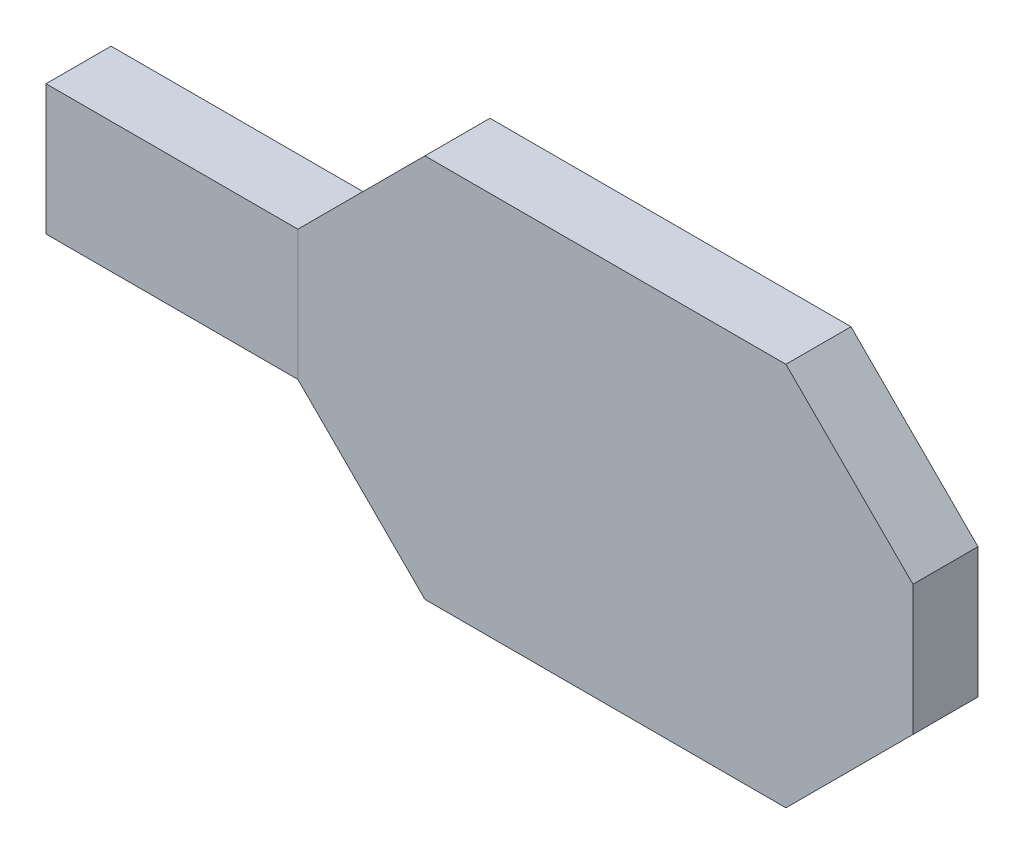
ISO-10303-21;
HEADER;
FILE_DESCRIPTION(('STEP AP214'),'2;1');
FILE_NAME('part.step','',(''),(''),'','','');
FILE_SCHEMA(('AUTOMOTIVE_DESIGN { 1 0 10303 214 1 1 1 1 }'));
ENDSEC;
DATA;
#1=APPLICATION_CONTEXT('core data for automotive mechanical design processes');
#2=APPLICATION_PROTOCOL_DEFINITION('international standard','automotive_design',2000,#1);
#3=PRODUCT_CONTEXT('',#1,'mechanical');
#4=PRODUCT('Part','Part','',(#3));
#5=PRODUCT_RELATED_PRODUCT_CATEGORY('part','',(#4));
#6=PRODUCT_DEFINITION_FORMATION('','',#4);
#7=PRODUCT_DEFINITION_CONTEXT('part definition',#1,'design');
#8=PRODUCT_DEFINITION('design','',#6,#7);
#9=PRODUCT_DEFINITION_SHAPE('','',#8);
#10=(LENGTH_UNIT() NAMED_UNIT(*) SI_UNIT(.MILLI.,.METRE.));
#11=(NAMED_UNIT(*) PLANE_ANGLE_UNIT() SI_UNIT($,.RADIAN.));
#12=(NAMED_UNIT(*) SI_UNIT($,.STERADIAN.) SOLID_ANGLE_UNIT());
#13=UNCERTAINTY_MEASURE_WITH_UNIT(LENGTH_MEASURE(1.E-05),#10,'distance_accuracy_value','');
#14=(GEOMETRIC_REPRESENTATION_CONTEXT(3) GLOBAL_UNCERTAINTY_ASSIGNED_CONTEXT((#13)) GLOBAL_UNIT_ASSIGNED_CONTEXT((#10,
#11,#12)) REPRESENTATION_CONTEXT('',''));
#15=CARTESIAN_POINT('',(0.,0.,0.));
#16=DIRECTION('',(0.,0.,1.));
#17=DIRECTION('',(1.,0.,0.));
#18=AXIS2_PLACEMENT_3D('',#15,#16,#17);
#19=CARTESIAN_POINT('',(0.3,1.385,0.));
#20=DIRECTION('',(0.,-1.,0.));
#21=DIRECTION('',(0.,0.,-1.));
#22=AXIS2_PLACEMENT_3D('',#19,#20,#21);
#23=PLANE('',#22);
#24=DIRECTION('',(0.,0.,1.));
#25=VECTOR('',#24,1.);
#26=CARTESIAN_POINT('',(0.905,1.385,0.));
#27=LINE('',#26,#25);
#28=CARTESIAN_POINT('',(0.905,1.385,0.));
#29=VERTEX_POINT('',#28);
#30=CARTESIAN_POINT('',(0.905,1.385,0.31));
#31=VERTEX_POINT('',#30);
#32=EDGE_CURVE('E127',#29,#31,#27,.T.);
#33=ORIENTED_EDGE('',*,*,#32,.F.);
#34=DIRECTION('',(1.,0.,0.));
#35=VECTOR('',#34,1.);
#36=CARTESIAN_POINT('',(0.3,1.385,0.));
#37=LINE('',#36,#35);
#38=CARTESIAN_POINT('',(2.625,1.385,0.));
#39=VERTEX_POINT('',#38);
#40=EDGE_CURVE('E130',#29,#39,#37,.T.);
#41=ORIENTED_EDGE('',*,*,#40,.T.);
#42=DIRECTION('',(0.,0.,1.));
#43=VECTOR('',#42,1.);
#44=CARTESIAN_POINT('',(2.625,1.385,0.));
#45=LINE('',#44,#43);
#46=CARTESIAN_POINT('',(2.625,1.385,0.31));
#47=VERTEX_POINT('',#46);
#48=EDGE_CURVE('E11',#39,#47,#45,.T.);
#49=ORIENTED_EDGE('',*,*,#48,.T.);
#50=DIRECTION('',(1.,0.,0.));
#51=VECTOR('',#50,1.);
#52=CARTESIAN_POINT('',(0.3,1.385,0.31));
#53=LINE('',#52,#51);
#54=EDGE_CURVE('E133',#31,#47,#53,.T.);
#55=ORIENTED_EDGE('',*,*,#54,.F.);
#56=EDGE_LOOP('',(#33,#41,#49,#55));
#57=FACE_BOUND('',#56,.T.);
#58=ADVANCED_FACE('F16',(#57),#23,.T.);
#59=CARTESIAN_POINT('',(2.625,1.385,0.));
#60=DIRECTION('',(-0.707106781186548,0.707106781186548,0.));
#61=DIRECTION('',(0.,0.,1.));
#62=AXIS2_PLACEMENT_3D('',#59,#60,#61);
#63=PLANE('',#62);
#64=ORIENTED_EDGE('',*,*,#48,.F.);
#65=DIRECTION('',(0.707106781186548,0.707106781186548,0.));
#66=VECTOR('',#65,1.);
#67=CARTESIAN_POINT('',(2.625,1.385,0.));
#68=LINE('',#67,#66);
#69=CARTESIAN_POINT('',(3.23,1.99,0.));
#70=VERTEX_POINT('',#69);
#71=EDGE_CURVE('E153',#39,#70,#68,.T.);
#72=ORIENTED_EDGE('',*,*,#71,.T.);
#73=DIRECTION('',(0.,0.,1.));
#74=VECTOR('',#73,1.);
#75=CARTESIAN_POINT('',(3.23,1.99,0.));
#76=LINE('',#75,#74);
#77=CARTESIAN_POINT('',(3.23,1.99,0.31));
#78=VERTEX_POINT('',#77);
#79=EDGE_CURVE('E27',#70,#78,#76,.T.);
#80=ORIENTED_EDGE('',*,*,#79,.T.);
#81=DIRECTION('',(0.707106781186548,0.707106781186548,0.));
#82=VECTOR('',#81,1.);
#83=CARTESIAN_POINT('',(2.625,1.385,0.31));
#84=LINE('',#83,#82);
#85=EDGE_CURVE('E182',#47,#78,#84,.T.);
#86=ORIENTED_EDGE('',*,*,#85,.F.);
#87=EDGE_LOOP('',(#64,#72,#80,#86));
#88=FACE_BOUND('',#87,.T.);
#89=ADVANCED_FACE('F419',(#88),#63,.F.);
#90=CARTESIAN_POINT('',(3.23,3.215,0.));
#91=DIRECTION('',(1.,0.,0.));
#92=DIRECTION('',(0.,1.,0.));
#93=AXIS2_PLACEMENT_3D('',#90,#91,#92);
#94=PLANE('',#93);
#95=DIRECTION('',(0.,-1.,0.));
#96=VECTOR('',#95,1.);
#97=CARTESIAN_POINT('',(3.23,3.215,0.));
#98=LINE('',#97,#96);
#99=CARTESIAN_POINT('',(3.23,2.61,0.));
#100=VERTEX_POINT('',#99);
#101=EDGE_CURVE('E160',#100,#70,#98,.T.);
#102=ORIENTED_EDGE('',*,*,#101,.F.);
#103=DIRECTION('',(0.,0.,1.));
#104=VECTOR('',#103,1.);
#105=CARTESIAN_POINT('',(3.23,2.61,0.));
#106=LINE('',#105,#104);
#107=CARTESIAN_POINT('',(3.23,2.61,0.31));
#108=VERTEX_POINT('',#107);
#109=EDGE_CURVE('E41',#100,#108,#106,.T.);
#110=ORIENTED_EDGE('',*,*,#109,.T.);
#111=DIRECTION('',(0.,-1.,0.));
#112=VECTOR('',#111,1.);
#113=CARTESIAN_POINT('',(3.23,3.215,0.31));
#114=LINE('',#113,#112);
#115=EDGE_CURVE('E179',#108,#78,#114,.T.);
#116=ORIENTED_EDGE('',*,*,#115,.T.);
#117=ORIENTED_EDGE('',*,*,#79,.F.);
#118=EDGE_LOOP('',(#102,#110,#116,#117));
#119=FACE_BOUND('',#118,.T.);
#120=ADVANCED_FACE('F377',(#119),#94,.T.);
#121=CARTESIAN_POINT('',(3.23,2.61,0.));
#122=DIRECTION('',(-0.707106781186548,-0.707106781186548,0.));
#123=DIRECTION('',(-0.707106781186548,0.707106781186548,0.));
#124=AXIS2_PLACEMENT_3D('',#121,#122,#123);
#125=PLANE('',#124);
#126=ORIENTED_EDGE('',*,*,#109,.F.);
#127=DIRECTION('',(-0.707106781186548,0.707106781186548,0.));
#128=VECTOR('',#127,1.);
#129=CARTESIAN_POINT('',(3.23,2.61,0.));
#130=LINE('',#129,#128);
#131=CARTESIAN_POINT('',(2.625,3.215,0.));
#132=VERTEX_POINT('',#131);
#133=EDGE_CURVE('E171',#100,#132,#130,.T.);
#134=ORIENTED_EDGE('',*,*,#133,.T.);
#135=DIRECTION('',(0.,0.,1.));
#136=VECTOR('',#135,1.);
#137=CARTESIAN_POINT('',(2.625,3.215,0.));
#138=LINE('',#137,#136);
#139=CARTESIAN_POINT('',(2.625,3.215,0.31));
#140=VERTEX_POINT('',#139);
#141=EDGE_CURVE('E20',#132,#140,#138,.T.);
#142=ORIENTED_EDGE('',*,*,#141,.T.);
#143=DIRECTION('',(-0.707106781186548,0.707106781186548,0.));
#144=VECTOR('',#143,1.);
#145=CARTESIAN_POINT('',(3.23,2.61,0.31));
#146=LINE('',#145,#144);
#147=EDGE_CURVE('E181',#108,#140,#146,.T.);
#148=ORIENTED_EDGE('',*,*,#147,.F.);
#149=EDGE_LOOP('',(#126,#134,#142,#148));
#150=FACE_BOUND('',#149,.T.);
#151=ADVANCED_FACE('F265',(#150),#125,.F.);
#152=CARTESIAN_POINT('',(0.3,3.215,0.));
#153=DIRECTION('',(0.,-1.,0.));
#154=DIRECTION('',(0.,0.,-1.));
#155=AXIS2_PLACEMENT_3D('',#152,#153,#154);
#156=PLANE('',#155);
#157=DIRECTION('',(0.,0.,1.));
#158=VECTOR('',#157,1.);
#159=CARTESIAN_POINT('',(0.905,3.215,0.));
#160=LINE('',#159,#158);
#161=CARTESIAN_POINT('',(0.905,3.215,0.));
#162=VERTEX_POINT('',#161);
#163=CARTESIAN_POINT('',(0.905,3.215,0.31));
#164=VERTEX_POINT('',#163);
#165=EDGE_CURVE('E115',#162,#164,#160,.T.);
#166=ORIENTED_EDGE('',*,*,#165,.T.);
#167=DIRECTION('',(1.,0.,0.));
#168=VECTOR('',#167,1.);
#169=CARTESIAN_POINT('',(0.3,3.215,0.31));
#170=LINE('',#169,#168);
#171=EDGE_CURVE('E167',#164,#140,#170,.T.);
#172=ORIENTED_EDGE('',*,*,#171,.T.);
#173=ORIENTED_EDGE('',*,*,#141,.F.);
#174=DIRECTION('',(1.,0.,0.));
#175=VECTOR('',#174,1.);
#176=CARTESIAN_POINT('',(0.3,3.215,0.));
#177=LINE('',#176,#175);
#178=EDGE_CURVE('E168',#162,#132,#177,.T.);
#179=ORIENTED_EDGE('',*,*,#178,.F.);
#180=EDGE_LOOP('',(#166,#172,#173,#179));
#181=FACE_BOUND('',#180,.T.);
#182=ADVANCED_FACE('F262',(#181),#156,.F.);
#183=CARTESIAN_POINT('',(0.905,3.215,0.));
#184=DIRECTION('',(0.707106781186548,-0.707106781186548,0.));
#185=DIRECTION('',(0.,0.,-1.));
#186=AXIS2_PLACEMENT_3D('',#183,#184,#185);
#187=PLANE('',#186);
#188=ORIENTED_EDGE('',*,*,#165,.F.);
#189=DIRECTION('',(-0.707106781186548,-0.707106781186548,0.));
#190=VECTOR('',#189,1.);
#191=CARTESIAN_POINT('',(0.905,3.215,0.));
#192=LINE('',#191,#190);
#193=CARTESIAN_POINT('',(0.3,2.61,0.));
#194=VERTEX_POINT('',#193);
#195=EDGE_CURVE('E139',#162,#194,#192,.T.);
#196=ORIENTED_EDGE('',*,*,#195,.T.);
#197=DIRECTION('',(0.,0.,1.));
#198=VECTOR('',#197,1.);
#199=CARTESIAN_POINT('',(0.3,2.61,0.));
#200=LINE('',#199,#198);
#201=CARTESIAN_POINT('',(0.3,2.61,0.31));
#202=VERTEX_POINT('',#201);
#203=EDGE_CURVE('E172',#194,#202,#200,.T.);
#204=ORIENTED_EDGE('',*,*,#203,.T.);
#205=DIRECTION('',(-0.707106781186548,-0.707106781186548,0.));
#206=VECTOR('',#205,1.);
#207=CARTESIAN_POINT('',(0.905,3.215,0.31));
#208=LINE('',#207,#206);
#209=EDGE_CURVE('E195',#164,#202,#208,.T.);
#210=ORIENTED_EDGE('',*,*,#209,.F.);
#211=EDGE_LOOP('',(#188,#196,#204,#210));
#212=FACE_BOUND('',#211,.T.);
#213=ADVANCED_FACE('F405',(#212),#187,.F.);
#214=CARTESIAN_POINT('',(0.3,3.215,0.31));
#215=DIRECTION('',(0.,0.,1.));
#216=DIRECTION('',(1.,0.,0.));
#217=AXIS2_PLACEMENT_3D('',#214,#215,#216);
#218=PLANE('',#217);
#219=ORIENTED_EDGE('',*,*,#171,.F.);
#220=ORIENTED_EDGE('',*,*,#209,.T.);
#221=DIRECTION('',(0.,-1.,0.));
#222=VECTOR('',#221,1.);
#223=CARTESIAN_POINT('',(0.3,3.215,0.31));
#224=LINE('',#223,#222);
#225=CARTESIAN_POINT('',(0.3,1.99,0.31));
#226=VERTEX_POINT('',#225);
#227=EDGE_CURVE('E202',#202,#226,#224,.T.);
#228=ORIENTED_EDGE('',*,*,#227,.T.);
#229=DIRECTION('',(0.707106781186548,-0.707106781186548,0.));
#230=VECTOR('',#229,1.);
#231=CARTESIAN_POINT('',(0.3,1.99,0.31));
#232=LINE('',#231,#230);
#233=EDGE_CURVE('E138',#226,#31,#232,.T.);
#234=ORIENTED_EDGE('',*,*,#233,.T.);
#235=ORIENTED_EDGE('',*,*,#54,.T.);
#236=ORIENTED_EDGE('',*,*,#85,.T.);
#237=ORIENTED_EDGE('',*,*,#115,.F.);
#238=ORIENTED_EDGE('',*,*,#147,.T.);
#239=EDGE_LOOP('',(#219,#220,#228,#234,#235,#236,#237,#238));
#240=FACE_BOUND('',#239,.T.);
#241=ADVANCED_FACE('F410',(#240),#218,.T.);
#242=CARTESIAN_POINT('',(0.3,1.99,0.));
#243=DIRECTION('',(0.707106781186548,0.707106781186548,0.));
#244=DIRECTION('',(0.,0.,-1.));
#245=AXIS2_PLACEMENT_3D('',#242,#243,#244);
#246=PLANE('',#245);
#247=DIRECTION('',(0.,0.,1.));
#248=VECTOR('',#247,1.);
#249=CARTESIAN_POINT('',(0.3,1.99,0.));
#250=LINE('',#249,#248);
#251=CARTESIAN_POINT('',(0.3,1.99,0.));
#252=VERTEX_POINT('',#251);
#253=EDGE_CURVE('E143',#252,#226,#250,.T.);
#254=ORIENTED_EDGE('',*,*,#253,.F.);
#255=DIRECTION('',(0.707106781186548,-0.707106781186548,0.));
#256=VECTOR('',#255,1.);
#257=CARTESIAN_POINT('',(0.3,1.99,0.));
#258=LINE('',#257,#256);
#259=EDGE_CURVE('E141',#252,#29,#258,.T.);
#260=ORIENTED_EDGE('',*,*,#259,.T.);
#261=ORIENTED_EDGE('',*,*,#32,.T.);
#262=ORIENTED_EDGE('',*,*,#233,.F.);
#263=EDGE_LOOP('',(#254,#260,#261,#262));
#264=FACE_BOUND('',#263,.T.);
#265=ADVANCED_FACE('F18',(#264),#246,.F.);
#266=CARTESIAN_POINT('',(0.3,3.215,0.));
#267=DIRECTION('',(0.,0.,1.));
#268=DIRECTION('',(1.,0.,0.));
#269=AXIS2_PLACEMENT_3D('',#266,#267,#268);
#270=PLANE('',#269);
#271=ORIENTED_EDGE('',*,*,#178,.T.);
#272=ORIENTED_EDGE('',*,*,#133,.F.);
#273=ORIENTED_EDGE('',*,*,#101,.T.);
#274=ORIENTED_EDGE('',*,*,#71,.F.);
#275=ORIENTED_EDGE('',*,*,#40,.F.);
#276=ORIENTED_EDGE('',*,*,#259,.F.);
#277=DIRECTION('',(0.,-1.,0.));
#278=VECTOR('',#277,1.);
#279=CARTESIAN_POINT('',(0.3,3.215,0.));
#280=LINE('',#279,#278);
#281=EDGE_CURVE('E190',#194,#252,#280,.T.);
#282=ORIENTED_EDGE('',*,*,#281,.F.);
#283=ORIENTED_EDGE('',*,*,#195,.F.);
#284=EDGE_LOOP('',(#271,#272,#273,#274,#275,#276,#282,#283));
#285=FACE_BOUND('',#284,.T.);
#286=ADVANCED_FACE('F150',(#285),#270,.F.);
#287=CARTESIAN_POINT('',(-0.9,2.61,0.));
#288=DIRECTION('',(0.,-1.,0.));
#289=DIRECTION('',(0.,0.,-1.));
#290=AXIS2_PLACEMENT_3D('',#287,#288,#289);
#291=PLANE('',#290);
#292=DIRECTION('',(0.,0.,1.));
#293=VECTOR('',#292,1.);
#294=CARTESIAN_POINT('',(-0.9,2.61,0.));
#295=LINE('',#294,#293);
#296=CARTESIAN_POINT('',(-0.9,2.61,0.));
#297=VERTEX_POINT('',#296);
#298=CARTESIAN_POINT('',(-0.9,2.61,0.31));
#299=VERTEX_POINT('',#298);
#300=EDGE_CURVE('E177',#297,#299,#295,.T.);
#301=ORIENTED_EDGE('',*,*,#300,.T.);
#302=DIRECTION('',(1.,0.,0.));
#303=VECTOR('',#302,1.);
#304=CARTESIAN_POINT('',(-0.9,2.61,0.31));
#305=LINE('',#304,#303);
#306=EDGE_CURVE('E198',#299,#202,#305,.T.);
#307=ORIENTED_EDGE('',*,*,#306,.T.);
#308=ORIENTED_EDGE('',*,*,#203,.F.);
#309=DIRECTION('',(1.,0.,0.));
#310=VECTOR('',#309,1.);
#311=CARTESIAN_POINT('',(-0.9,2.61,0.));
#312=LINE('',#311,#310);
#313=EDGE_CURVE('E186',#297,#194,#312,.T.);
#314=ORIENTED_EDGE('',*,*,#313,.F.);
#315=EDGE_LOOP('',(#301,#307,#308,#314));
#316=FACE_BOUND('',#315,.T.);
#317=ADVANCED_FACE('F258',(#316),#291,.F.);
#318=CARTESIAN_POINT('',(-0.9,2.61,0.31));
#319=DIRECTION('',(0.,0.,1.));
#320=DIRECTION('',(1.,0.,0.));
#321=AXIS2_PLACEMENT_3D('',#318,#319,#320);
#322=PLANE('',#321);
#323=ORIENTED_EDGE('',*,*,#306,.F.);
#324=DIRECTION('',(0.,-1.,0.));
#325=VECTOR('',#324,1.);
#326=CARTESIAN_POINT('',(-0.9,2.61,0.31));
#327=LINE('',#326,#325);
#328=CARTESIAN_POINT('',(-0.9,1.99,0.31));
#329=VERTEX_POINT('',#328);
#330=EDGE_CURVE('E173',#299,#329,#327,.T.);
#331=ORIENTED_EDGE('',*,*,#330,.T.);
#332=DIRECTION('',(1.,0.,0.));
#333=VECTOR('',#332,1.);
#334=CARTESIAN_POINT('',(-0.9,1.99,0.31));
#335=LINE('',#334,#333);
#336=EDGE_CURVE('E203',#329,#226,#335,.T.);
#337=ORIENTED_EDGE('',*,*,#336,.T.);
#338=ORIENTED_EDGE('',*,*,#227,.F.);
#339=EDGE_LOOP('',(#323,#331,#337,#338));
#340=FACE_BOUND('',#339,.T.);
#341=ADVANCED_FACE('F255',(#340),#322,.T.);
#342=CARTESIAN_POINT('',(-0.9,1.99,0.));
#343=DIRECTION('',(0.,-1.,0.));
#344=DIRECTION('',(0.,0.,-1.));
#345=AXIS2_PLACEMENT_3D('',#342,#343,#344);
#346=PLANE('',#345);
#347=DIRECTION('',(0.,0.,1.));
#348=VECTOR('',#347,1.);
#349=CARTESIAN_POINT('',(-0.9,1.99,0.));
#350=LINE('',#349,#348);
#351=CARTESIAN_POINT('',(-0.9,1.99,0.));
#352=VERTEX_POINT('',#351);
#353=EDGE_CURVE('E178',#352,#329,#350,.T.);
#354=ORIENTED_EDGE('',*,*,#353,.F.);
#355=DIRECTION('',(1.,0.,0.));
#356=VECTOR('',#355,1.);
#357=CARTESIAN_POINT('',(-0.9,1.99,0.));
#358=LINE('',#357,#356);
#359=EDGE_CURVE('E213',#352,#252,#358,.T.);
#360=ORIENTED_EDGE('',*,*,#359,.T.);
#361=ORIENTED_EDGE('',*,*,#253,.T.);
#362=ORIENTED_EDGE('',*,*,#336,.F.);
#363=EDGE_LOOP('',(#354,#360,#361,#362));
#364=FACE_BOUND('',#363,.T.);
#365=ADVANCED_FACE('F252',(#364),#346,.T.);
#366=CARTESIAN_POINT('',(-0.9,2.61,0.));
#367=DIRECTION('',(0.,0.,1.));
#368=DIRECTION('',(1.,0.,0.));
#369=AXIS2_PLACEMENT_3D('',#366,#367,#368);
#370=PLANE('',#369);
#371=ORIENTED_EDGE('',*,*,#313,.T.);
#372=ORIENTED_EDGE('',*,*,#281,.T.);
#373=ORIENTED_EDGE('',*,*,#359,.F.);
#374=DIRECTION('',(0.,-1.,0.));
#375=VECTOR('',#374,1.);
#376=CARTESIAN_POINT('',(-0.9,2.61,0.));
#377=LINE('',#376,#375);
#378=EDGE_CURVE('E212',#297,#352,#377,.T.);
#379=ORIENTED_EDGE('',*,*,#378,.F.);
#380=EDGE_LOOP('',(#371,#372,#373,#379));
#381=FACE_BOUND('',#380,.T.);
#382=ADVANCED_FACE('F250',(#381),#370,.F.);
#383=CARTESIAN_POINT('',(-0.9,2.61,0.));
#384=DIRECTION('',(1.,0.,0.));
#385=DIRECTION('',(0.,1.,0.));
#386=AXIS2_PLACEMENT_3D('',#383,#384,#385);
#387=PLANE('',#386);
#388=ORIENTED_EDGE('',*,*,#378,.T.);
#389=ORIENTED_EDGE('',*,*,#353,.T.);
#390=ORIENTED_EDGE('',*,*,#330,.F.);
#391=ORIENTED_EDGE('',*,*,#300,.F.);
#392=EDGE_LOOP('',(#388,#389,#390,#391));
#393=FACE_BOUND('',#392,.T.);
#394=ADVANCED_FACE('F246',(#393),#387,.F.);
#395=CLOSED_SHELL('',(#58,#89,#120,#151,#182,#213,#241,#265,#286,#317,#341,#365,#382,#394));
#396=MANIFOLD_SOLID_BREP('B1',#395);
#397=ADVANCED_BREP_SHAPE_REPRESENTATION('',(#18,#396),#14);
#398=SHAPE_DEFINITION_REPRESENTATION(#9,#397);
ENDSEC;
END-ISO-10303-21;
